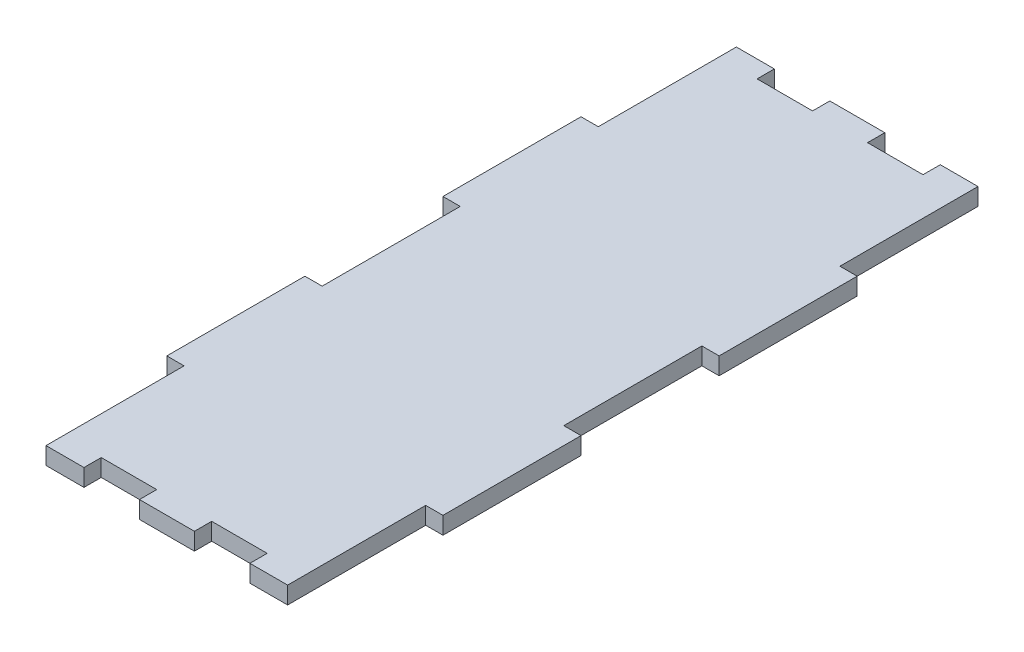
ISO-10303-21;
HEADER;
FILE_DESCRIPTION(('STEP AP214'),'2;1');
FILE_NAME('part.step','',(''),(''),'','','');
FILE_SCHEMA(('AUTOMOTIVE_DESIGN { 1 0 10303 214 1 1 1 1 }'));
ENDSEC;
DATA;
#1=APPLICATION_CONTEXT('core data for automotive mechanical design processes');
#2=APPLICATION_PROTOCOL_DEFINITION('international standard','automotive_design',2000,#1);
#3=PRODUCT_CONTEXT('',#1,'mechanical');
#4=PRODUCT('Part','Part','',(#3));
#5=PRODUCT_RELATED_PRODUCT_CATEGORY('part','',(#4));
#6=PRODUCT_DEFINITION_FORMATION('','',#4);
#7=PRODUCT_DEFINITION_CONTEXT('part definition',#1,'design');
#8=PRODUCT_DEFINITION('design','',#6,#7);
#9=PRODUCT_DEFINITION_SHAPE('','',#8);
#10=(LENGTH_UNIT() NAMED_UNIT(*) SI_UNIT(.MILLI.,.METRE.));
#11=(NAMED_UNIT(*) PLANE_ANGLE_UNIT() SI_UNIT($,.RADIAN.));
#12=(NAMED_UNIT(*) SI_UNIT($,.STERADIAN.) SOLID_ANGLE_UNIT());
#13=UNCERTAINTY_MEASURE_WITH_UNIT(LENGTH_MEASURE(1.E-05),#10,'distance_accuracy_value','');
#14=(GEOMETRIC_REPRESENTATION_CONTEXT(3) GLOBAL_UNCERTAINTY_ASSIGNED_CONTEXT((#13)) GLOBAL_UNIT_ASSIGNED_CONTEXT((#10,
#11,#12)) REPRESENTATION_CONTEXT('',''));
#15=CARTESIAN_POINT('',(0.,0.,0.));
#16=DIRECTION('',(0.,0.,1.));
#17=DIRECTION('',(1.,0.,0.));
#18=AXIS2_PLACEMENT_3D('',#15,#16,#17);
#19=CARTESIAN_POINT('',(-25.4,3.175,-63.5));
#20=DIRECTION('',(0.,0.,1.));
#21=DIRECTION('',(1.,0.,0.));
#22=AXIS2_PLACEMENT_3D('',#19,#20,#21);
#23=PLANE('',#22);
#24=DIRECTION('',(-1.,0.,0.));
#25=VECTOR('',#24,1.);
#26=CARTESIAN_POINT('',(-25.4,3.175,-63.5));
#27=LINE('',#26,#25);
#28=CARTESIAN_POINT('',(-15.24,3.175,-63.5));
#29=VERTEX_POINT('',#28);
#30=CARTESIAN_POINT('',(-22.225,3.175,-63.5));
#31=VERTEX_POINT('',#30);
#32=EDGE_CURVE('E512',#29,#31,#27,.T.);
#33=ORIENTED_EDGE('',*,*,#32,.F.);
#34=DIRECTION('',(0.,1.,0.));
#35=VECTOR('',#34,1.);
#36=CARTESIAN_POINT('',(-15.24,0.,-63.5));
#37=LINE('',#36,#35);
#38=CARTESIAN_POINT('',(-15.24,0.,-63.5));
#39=VERTEX_POINT('',#38);
#40=EDGE_CURVE('E299',#39,#29,#37,.T.);
#41=ORIENTED_EDGE('',*,*,#40,.F.);
#42=DIRECTION('',(-1.,0.,0.));
#43=VECTOR('',#42,1.);
#44=CARTESIAN_POINT('',(-25.4,0.,-63.5));
#45=LINE('',#44,#43);
#46=CARTESIAN_POINT('',(-22.225,0.,-63.5));
#47=VERTEX_POINT('',#46);
#48=EDGE_CURVE('E289',#39,#47,#45,.T.);
#49=ORIENTED_EDGE('',*,*,#48,.T.);
#50=DIRECTION('',(0.,1.,0.));
#51=VECTOR('',#50,1.);
#52=CARTESIAN_POINT('',(-22.225,0.,-63.5));
#53=LINE('',#52,#51);
#54=EDGE_CURVE('E476',#47,#31,#53,.T.);
#55=ORIENTED_EDGE('',*,*,#54,.T.);
#56=EDGE_LOOP('',(#33,#41,#49,#55));
#57=FACE_BOUND('',#56,.T.);
#58=ADVANCED_FACE('F33',(#57),#23,.F.);
#59=CARTESIAN_POINT('',(-25.4,3.175,63.5));
#60=DIRECTION('',(0.,0.,-1.));
#61=DIRECTION('',(-1.,0.,0.));
#62=AXIS2_PLACEMENT_3D('',#59,#60,#61);
#63=PLANE('',#62);
#64=DIRECTION('',(1.,0.,0.));
#65=VECTOR('',#64,1.);
#66=CARTESIAN_POINT('',(-25.4,0.,63.5));
#67=LINE('',#66,#65);
#68=CARTESIAN_POINT('',(-22.225,0.,63.5));
#69=VERTEX_POINT('',#68);
#70=CARTESIAN_POINT('',(-15.24,0.,63.5));
#71=VERTEX_POINT('',#70);
#72=EDGE_CURVE('E37',#69,#71,#67,.T.);
#73=ORIENTED_EDGE('',*,*,#72,.T.);
#74=DIRECTION('',(0.,1.,0.));
#75=VECTOR('',#74,1.);
#76=CARTESIAN_POINT('',(-15.24,0.,63.5));
#77=LINE('',#76,#75);
#78=CARTESIAN_POINT('',(-15.24,3.175,63.5));
#79=VERTEX_POINT('',#78);
#80=EDGE_CURVE('E314',#71,#79,#77,.T.);
#81=ORIENTED_EDGE('',*,*,#80,.T.);
#82=DIRECTION('',(1.,0.,0.));
#83=VECTOR('',#82,1.);
#84=CARTESIAN_POINT('',(-25.4,3.175,63.5));
#85=LINE('',#84,#83);
#86=CARTESIAN_POINT('',(-22.225,3.175,63.5));
#87=VERTEX_POINT('',#86);
#88=EDGE_CURVE('E11',#87,#79,#85,.T.);
#89=ORIENTED_EDGE('',*,*,#88,.F.);
#90=DIRECTION('',(0.,1.,0.));
#91=VECTOR('',#90,1.);
#92=CARTESIAN_POINT('',(-22.225,0.,63.5));
#93=LINE('',#92,#91);
#94=EDGE_CURVE('E454',#69,#87,#93,.T.);
#95=ORIENTED_EDGE('',*,*,#94,.F.);
#96=EDGE_LOOP('',(#73,#81,#89,#95));
#97=FACE_BOUND('',#96,.T.);
#98=ADVANCED_FACE('F658',(#97),#63,.F.);
#99=CARTESIAN_POINT('',(5.08,0.,-63.5));
#100=VERTEX_POINT('',#99);
#101=CARTESIAN_POINT('',(-5.03435241381755,0.,-63.5));
#102=VERTEX_POINT('',#101);
#103=EDGE_CURVE('E526',#100,#102,#45,.T.);
#104=ORIENTED_EDGE('',*,*,#103,.T.);
#105=DIRECTION('',(0.,1.,0.));
#106=VECTOR('',#105,1.);
#107=CARTESIAN_POINT('',(-5.03435241381755,0.,-63.5));
#108=LINE('',#107,#106);
#109=CARTESIAN_POINT('',(-5.03435241381755,3.175,-63.5));
#110=VERTEX_POINT('',#109);
#111=EDGE_CURVE('E302',#102,#110,#108,.T.);
#112=ORIENTED_EDGE('',*,*,#111,.T.);
#113=CARTESIAN_POINT('',(5.08,3.175,-63.5));
#114=VERTEX_POINT('',#113);
#115=EDGE_CURVE('E518',#114,#110,#27,.T.);
#116=ORIENTED_EDGE('',*,*,#115,.F.);
#117=DIRECTION('',(0.,1.,0.));
#118=VECTOR('',#117,1.);
#119=CARTESIAN_POINT('',(5.08,0.,-63.5));
#120=LINE('',#119,#118);
#121=EDGE_CURVE('E348',#100,#114,#120,.T.);
#122=ORIENTED_EDGE('',*,*,#121,.F.);
#123=EDGE_LOOP('',(#104,#112,#116,#122));
#124=FACE_BOUND('',#123,.T.);
#125=ADVANCED_FACE('F580',(#124),#23,.F.);
#126=CARTESIAN_POINT('',(-5.03435241381755,3.175,63.5));
#127=VERTEX_POINT('',#126);
#128=CARTESIAN_POINT('',(5.08,3.175,63.5));
#129=VERTEX_POINT('',#128);
#130=EDGE_CURVE('E42',#127,#129,#85,.T.);
#131=ORIENTED_EDGE('',*,*,#130,.F.);
#132=DIRECTION('',(0.,1.,0.));
#133=VECTOR('',#132,1.);
#134=CARTESIAN_POINT('',(-5.03435241381755,0.,63.5));
#135=LINE('',#134,#133);
#136=CARTESIAN_POINT('',(-5.03435241381755,0.,63.5));
#137=VERTEX_POINT('',#136);
#138=EDGE_CURVE('E325',#137,#127,#135,.T.);
#139=ORIENTED_EDGE('',*,*,#138,.F.);
#140=CARTESIAN_POINT('',(5.08,0.,63.5));
#141=VERTEX_POINT('',#140);
#142=EDGE_CURVE('E533',#137,#141,#67,.T.);
#143=ORIENTED_EDGE('',*,*,#142,.T.);
#144=DIRECTION('',(0.,1.,0.));
#145=VECTOR('',#144,1.);
#146=CARTESIAN_POINT('',(5.08,0.,63.5));
#147=LINE('',#146,#145);
#148=EDGE_CURVE('E367',#141,#129,#147,.T.);
#149=ORIENTED_EDGE('',*,*,#148,.T.);
#150=EDGE_LOOP('',(#131,#139,#143,#149));
#151=FACE_BOUND('',#150,.T.);
#152=ADVANCED_FACE('F669',(#151),#63,.F.);
#153=CARTESIAN_POINT('',(25.4,3.175,63.5));
#154=DIRECTION('',(-1.,0.,0.));
#155=DIRECTION('',(0.,0.,1.));
#156=AXIS2_PLACEMENT_3D('',#153,#154,#155);
#157=PLANE('',#156);
#158=DIRECTION('',(0.,0.,-1.));
#159=VECTOR('',#158,1.);
#160=CARTESIAN_POINT('',(25.4,3.175,63.5));
#161=LINE('',#160,#159);
#162=CARTESIAN_POINT('',(25.4,3.175,38.1));
#163=VERTEX_POINT('',#162);
#164=CARTESIAN_POINT('',(25.4,3.175,12.7));
#165=VERTEX_POINT('',#164);
#166=EDGE_CURVE('E510',#163,#165,#161,.T.);
#167=ORIENTED_EDGE('',*,*,#166,.F.);
#168=DIRECTION('',(0.,1.,0.));
#169=VECTOR('',#168,1.);
#170=CARTESIAN_POINT('',(25.4,0.,38.1));
#171=LINE('',#170,#169);
#172=CARTESIAN_POINT('',(25.4,0.,38.1));
#173=VERTEX_POINT('',#172);
#174=EDGE_CURVE('E389',#173,#163,#171,.T.);
#175=ORIENTED_EDGE('',*,*,#174,.F.);
#176=DIRECTION('',(0.,0.,-1.));
#177=VECTOR('',#176,1.);
#178=CARTESIAN_POINT('',(25.4,0.,63.5));
#179=LINE('',#178,#177);
#180=CARTESIAN_POINT('',(25.4,0.,12.7));
#181=VERTEX_POINT('',#180);
#182=EDGE_CURVE('E521',#173,#181,#179,.T.);
#183=ORIENTED_EDGE('',*,*,#182,.T.);
#184=DIRECTION('',(0.,1.,0.));
#185=VECTOR('',#184,1.);
#186=CARTESIAN_POINT('',(25.4,0.,12.7));
#187=LINE('',#186,#185);
#188=EDGE_CURVE('E419',#181,#165,#187,.T.);
#189=ORIENTED_EDGE('',*,*,#188,.T.);
#190=EDGE_LOOP('',(#167,#175,#183,#189));
#191=FACE_BOUND('',#190,.T.);
#192=ADVANCED_FACE('F627',(#191),#157,.F.);
#193=CARTESIAN_POINT('',(-25.4,3.175,63.5));
#194=DIRECTION('',(1.,0.,0.));
#195=DIRECTION('',(0.,0.,-1.));
#196=AXIS2_PLACEMENT_3D('',#193,#194,#195);
#197=PLANE('',#196);
#198=DIRECTION('',(0.,0.,1.));
#199=VECTOR('',#198,1.);
#200=CARTESIAN_POINT('',(-25.4,3.175,63.5));
#201=LINE('',#200,#199);
#202=CARTESIAN_POINT('',(-25.4,3.175,-38.1));
#203=VERTEX_POINT('',#202);
#204=CARTESIAN_POINT('',(-25.4,3.175,-12.7));
#205=VERTEX_POINT('',#204);
#206=EDGE_CURVE('E519',#203,#205,#201,.T.);
#207=ORIENTED_EDGE('',*,*,#206,.F.);
#208=DIRECTION('',(0.,1.,0.));
#209=VECTOR('',#208,1.);
#210=CARTESIAN_POINT('',(-25.4,0.,-38.1));
#211=LINE('',#210,#209);
#212=CARTESIAN_POINT('',(-25.4,0.,-38.1));
#213=VERTEX_POINT('',#212);
#214=EDGE_CURVE('E471',#213,#203,#211,.T.);
#215=ORIENTED_EDGE('',*,*,#214,.F.);
#216=DIRECTION('',(0.,0.,1.));
#217=VECTOR('',#216,1.);
#218=CARTESIAN_POINT('',(-25.4,0.,63.5));
#219=LINE('',#218,#217);
#220=CARTESIAN_POINT('',(-25.4,0.,-12.7));
#221=VERTEX_POINT('',#220);
#222=EDGE_CURVE('E527',#213,#221,#219,.T.);
#223=ORIENTED_EDGE('',*,*,#222,.T.);
#224=DIRECTION('',(0.,1.,0.));
#225=VECTOR('',#224,1.);
#226=CARTESIAN_POINT('',(-25.4,0.,-12.7));
#227=LINE('',#226,#225);
#228=EDGE_CURVE('E501',#221,#205,#227,.T.);
#229=ORIENTED_EDGE('',*,*,#228,.T.);
#230=EDGE_LOOP('',(#207,#215,#223,#229));
#231=FACE_BOUND('',#230,.T.);
#232=ADVANCED_FACE('F565',(#231),#197,.F.);
#233=CARTESIAN_POINT('',(25.4,3.175,-12.7));
#234=VERTEX_POINT('',#233);
#235=CARTESIAN_POINT('',(25.4,3.175,-38.1));
#236=VERTEX_POINT('',#235);
#237=EDGE_CURVE('E513',#234,#236,#161,.T.);
#238=ORIENTED_EDGE('',*,*,#237,.F.);
#239=DIRECTION('',(0.,1.,0.));
#240=VECTOR('',#239,1.);
#241=CARTESIAN_POINT('',(25.4,0.,-12.7));
#242=LINE('',#241,#240);
#243=CARTESIAN_POINT('',(25.4,0.,-12.7));
#244=VERTEX_POINT('',#243);
#245=EDGE_CURVE('E411',#244,#234,#242,.T.);
#246=ORIENTED_EDGE('',*,*,#245,.F.);
#247=CARTESIAN_POINT('',(25.4,0.,-38.1));
#248=VERTEX_POINT('',#247);
#249=EDGE_CURVE('E504',#244,#248,#179,.T.);
#250=ORIENTED_EDGE('',*,*,#249,.T.);
#251=DIRECTION('',(0.,1.,0.));
#252=VECTOR('',#251,1.);
#253=CARTESIAN_POINT('',(25.4,0.,-38.1));
#254=LINE('',#253,#252);
#255=EDGE_CURVE('E440',#248,#236,#254,.T.);
#256=ORIENTED_EDGE('',*,*,#255,.T.);
#257=EDGE_LOOP('',(#238,#246,#250,#256));
#258=FACE_BOUND('',#257,.T.);
#259=ADVANCED_FACE('F35',(#258),#157,.F.);
#260=CARTESIAN_POINT('',(22.225,0.,-63.5));
#261=VERTEX_POINT('',#260);
#262=CARTESIAN_POINT('',(15.2856475861824,0.,-63.5));
#263=VERTEX_POINT('',#262);
#264=EDGE_CURVE('E523',#261,#263,#45,.T.);
#265=ORIENTED_EDGE('',*,*,#264,.T.);
#266=DIRECTION('',(0.,1.,0.));
#267=VECTOR('',#266,1.);
#268=CARTESIAN_POINT('',(15.2856475861824,0.,-63.5));
#269=LINE('',#268,#267);
#270=CARTESIAN_POINT('',(15.2856475861824,3.175,-63.5));
#271=VERTEX_POINT('',#270);
#272=EDGE_CURVE('E351',#263,#271,#269,.T.);
#273=ORIENTED_EDGE('',*,*,#272,.T.);
#274=CARTESIAN_POINT('',(22.225,3.175,-63.5));
#275=VERTEX_POINT('',#274);
#276=EDGE_CURVE('E514',#275,#271,#27,.T.);
#277=ORIENTED_EDGE('',*,*,#276,.F.);
#278=DIRECTION('',(0.,1.,0.));
#279=VECTOR('',#278,1.);
#280=CARTESIAN_POINT('',(22.225,0.,-63.5));
#281=LINE('',#280,#279);
#282=EDGE_CURVE('E435',#261,#275,#281,.T.);
#283=ORIENTED_EDGE('',*,*,#282,.F.);
#284=EDGE_LOOP('',(#265,#273,#277,#283));
#285=FACE_BOUND('',#284,.T.);
#286=ADVANCED_FACE('F597',(#285),#23,.F.);
#287=CARTESIAN_POINT('',(-25.4,0.,12.7));
#288=VERTEX_POINT('',#287);
#289=CARTESIAN_POINT('',(-25.4,0.,38.1));
#290=VERTEX_POINT('',#289);
#291=EDGE_CURVE('E525',#288,#290,#219,.T.);
#292=ORIENTED_EDGE('',*,*,#291,.T.);
#293=DIRECTION('',(0.,1.,0.));
#294=VECTOR('',#293,1.);
#295=CARTESIAN_POINT('',(-25.4,0.,38.1));
#296=LINE('',#295,#294);
#297=CARTESIAN_POINT('',(-25.4,3.175,38.1));
#298=VERTEX_POINT('',#297);
#299=EDGE_CURVE('E458',#290,#298,#296,.T.);
#300=ORIENTED_EDGE('',*,*,#299,.T.);
#301=CARTESIAN_POINT('',(-25.4,3.175,12.7));
#302=VERTEX_POINT('',#301);
#303=EDGE_CURVE('E517',#302,#298,#201,.T.);
#304=ORIENTED_EDGE('',*,*,#303,.F.);
#305=DIRECTION('',(0.,1.,0.));
#306=VECTOR('',#305,1.);
#307=CARTESIAN_POINT('',(-25.4,0.,12.7));
#308=LINE('',#307,#306);
#309=EDGE_CURVE('E493',#288,#302,#308,.T.);
#310=ORIENTED_EDGE('',*,*,#309,.F.);
#311=EDGE_LOOP('',(#292,#300,#304,#310));
#312=FACE_BOUND('',#311,.T.);
#313=ADVANCED_FACE('F538',(#312),#197,.F.);
#314=CARTESIAN_POINT('',(15.2856475861824,3.175,63.5));
#315=VERTEX_POINT('',#314);
#316=CARTESIAN_POINT('',(22.225,3.175,63.5));
#317=VERTEX_POINT('',#316);
#318=EDGE_CURVE('E44',#315,#317,#85,.T.);
#319=ORIENTED_EDGE('',*,*,#318,.F.);
#320=DIRECTION('',(0.,1.,0.));
#321=VECTOR('',#320,1.);
#322=CARTESIAN_POINT('',(15.2856475861824,0.,63.5));
#323=LINE('',#322,#321);
#324=CARTESIAN_POINT('',(15.2856475861824,0.,63.5));
#325=VERTEX_POINT('',#324);
#326=EDGE_CURVE('E378',#325,#315,#323,.T.);
#327=ORIENTED_EDGE('',*,*,#326,.F.);
#328=CARTESIAN_POINT('',(22.225,0.,63.5));
#329=VERTEX_POINT('',#328);
#330=EDGE_CURVE('E528',#325,#329,#67,.T.);
#331=ORIENTED_EDGE('',*,*,#330,.T.);
#332=DIRECTION('',(0.,1.,0.));
#333=VECTOR('',#332,1.);
#334=CARTESIAN_POINT('',(22.225,0.,63.5));
#335=LINE('',#334,#333);
#336=EDGE_CURVE('E394',#329,#317,#335,.T.);
#337=ORIENTED_EDGE('',*,*,#336,.T.);
#338=EDGE_LOOP('',(#319,#327,#331,#337));
#339=FACE_BOUND('',#338,.T.);
#340=ADVANCED_FACE('F639',(#339),#63,.F.);
#341=CARTESIAN_POINT('',(0.,3.175,0.));
#342=DIRECTION('',(0.,-1.,0.));
#343=DIRECTION('',(0.,0.,-1.));
#344=AXIS2_PLACEMENT_3D('',#341,#342,#343);
#345=PLANE('',#344);
#346=DIRECTION('',(1.,0.,0.));
#347=VECTOR('',#346,1.);
#348=CARTESIAN_POINT('',(-15.24,3.175,-60.325));
#349=LINE('',#348,#347);
#350=CARTESIAN_POINT('',(-15.24,3.175,-60.325));
#351=VERTEX_POINT('',#350);
#352=CARTESIAN_POINT('',(-5.03435241381755,3.175,-60.325));
#353=VERTEX_POINT('',#352);
#354=EDGE_CURVE('E292',#351,#353,#349,.T.);
#355=ORIENTED_EDGE('',*,*,#354,.F.);
#356=DIRECTION('',(0.,0.,1.));
#357=VECTOR('',#356,1.);
#358=CARTESIAN_POINT('',(-15.24,3.175,-60.325));
#359=LINE('',#358,#357);
#360=EDGE_CURVE('E275',#29,#351,#359,.T.);
#361=ORIENTED_EDGE('',*,*,#360,.F.);
#362=ORIENTED_EDGE('',*,*,#32,.T.);
#363=DIRECTION('',(0.,0.,-1.));
#364=VECTOR('',#363,1.);
#365=CARTESIAN_POINT('',(-22.225,3.175,-38.1));
#366=LINE('',#365,#364);
#367=CARTESIAN_POINT('',(-22.225,3.175,-38.1));
#368=VERTEX_POINT('',#367);
#369=EDGE_CURVE('E469',#368,#31,#366,.T.);
#370=ORIENTED_EDGE('',*,*,#369,.F.);
#371=DIRECTION('',(1.,0.,0.));
#372=VECTOR('',#371,1.);
#373=CARTESIAN_POINT('',(-25.4,3.175,-38.1));
#374=LINE('',#373,#372);
#375=EDGE_CURVE('E461',#203,#368,#374,.T.);
#376=ORIENTED_EDGE('',*,*,#375,.F.);
#377=ORIENTED_EDGE('',*,*,#206,.T.);
#378=DIRECTION('',(-1.,0.,0.));
#379=VECTOR('',#378,1.);
#380=CARTESIAN_POINT('',(-25.4,3.175,-12.7));
#381=LINE('',#380,#379);
#382=CARTESIAN_POINT('',(-22.225,3.175,-12.7));
#383=VERTEX_POINT('',#382);
#384=EDGE_CURVE('E487',#383,#205,#381,.T.);
#385=ORIENTED_EDGE('',*,*,#384,.F.);
#386=DIRECTION('',(0.,0.,-1.));
#387=VECTOR('',#386,1.);
#388=CARTESIAN_POINT('',(-22.225,3.175,12.7));
#389=LINE('',#388,#387);
#390=CARTESIAN_POINT('',(-22.225,3.175,12.7));
#391=VERTEX_POINT('',#390);
#392=EDGE_CURVE('E496',#391,#383,#389,.T.);
#393=ORIENTED_EDGE('',*,*,#392,.F.);
#394=DIRECTION('',(1.,0.,0.));
#395=VECTOR('',#394,1.);
#396=CARTESIAN_POINT('',(-25.4,3.175,12.7));
#397=LINE('',#396,#395);
#398=EDGE_CURVE('E479',#302,#391,#397,.T.);
#399=ORIENTED_EDGE('',*,*,#398,.F.);
#400=ORIENTED_EDGE('',*,*,#303,.T.);
#401=DIRECTION('',(-1.,0.,0.));
#402=VECTOR('',#401,1.);
#403=CARTESIAN_POINT('',(-25.4,3.175,38.1));
#404=LINE('',#403,#402);
#405=CARTESIAN_POINT('',(-22.225,3.175,38.1));
#406=VERTEX_POINT('',#405);
#407=EDGE_CURVE('E451',#406,#298,#404,.T.);
#408=ORIENTED_EDGE('',*,*,#407,.F.);
#409=DIRECTION('',(0.,0.,-1.));
#410=VECTOR('',#409,1.);
#411=CARTESIAN_POINT('',(-22.225,3.175,63.5));
#412=LINE('',#411,#410);
#413=EDGE_CURVE('E443',#87,#406,#412,.T.);
#414=ORIENTED_EDGE('',*,*,#413,.F.);
#415=ORIENTED_EDGE('',*,*,#88,.T.);
#416=DIRECTION('',(0.,0.,1.));
#417=VECTOR('',#416,1.);
#418=CARTESIAN_POINT('',(-15.24,3.175,63.5));
#419=LINE('',#418,#417);
#420=CARTESIAN_POINT('',(-15.24,3.175,60.325));
#421=VERTEX_POINT('',#420);
#422=EDGE_CURVE('E315',#421,#79,#419,.T.);
#423=ORIENTED_EDGE('',*,*,#422,.F.);
#424=DIRECTION('',(-1.,0.,0.));
#425=VECTOR('',#424,1.);
#426=CARTESIAN_POINT('',(-15.24,3.175,60.325));
#427=LINE('',#426,#425);
#428=CARTESIAN_POINT('',(-5.03435241381755,3.175,60.325));
#429=VERTEX_POINT('',#428);
#430=EDGE_CURVE('E310',#429,#421,#427,.T.);
#431=ORIENTED_EDGE('',*,*,#430,.F.);
#432=DIRECTION('',(0.,0.,-1.));
#433=VECTOR('',#432,1.);
#434=CARTESIAN_POINT('',(-5.03435241381755,3.175,63.5));
#435=LINE('',#434,#433);
#436=EDGE_CURVE('E317',#127,#429,#435,.T.);
#437=ORIENTED_EDGE('',*,*,#436,.F.);
#438=ORIENTED_EDGE('',*,*,#130,.T.);
#439=DIRECTION('',(0.,0.,1.));
#440=VECTOR('',#439,1.);
#441=CARTESIAN_POINT('',(5.08,3.175,63.5));
#442=LINE('',#441,#440);
#443=CARTESIAN_POINT('',(5.08,3.175,60.325));
#444=VERTEX_POINT('',#443);
#445=EDGE_CURVE('E301',#444,#129,#442,.T.);
#446=ORIENTED_EDGE('',*,*,#445,.F.);
#447=DIRECTION('',(-1.,0.,0.));
#448=VECTOR('',#447,1.);
#449=CARTESIAN_POINT('',(5.08,3.175,60.325));
#450=LINE('',#449,#448);
#451=CARTESIAN_POINT('',(15.2856475861824,3.175,60.325));
#452=VERTEX_POINT('',#451);
#453=EDGE_CURVE('E361',#452,#444,#450,.T.);
#454=ORIENTED_EDGE('',*,*,#453,.F.);
#455=DIRECTION('',(0.,0.,-1.));
#456=VECTOR('',#455,1.);
#457=CARTESIAN_POINT('',(15.2856475861824,3.175,63.5));
#458=LINE('',#457,#456);
#459=EDGE_CURVE('E370',#315,#452,#458,.T.);
#460=ORIENTED_EDGE('',*,*,#459,.F.);
#461=ORIENTED_EDGE('',*,*,#318,.T.);
#462=DIRECTION('',(0.,0.,1.));
#463=VECTOR('',#462,1.);
#464=CARTESIAN_POINT('',(22.225,3.175,38.1));
#465=LINE('',#464,#463);
#466=CARTESIAN_POINT('',(22.225,3.175,38.1));
#467=VERTEX_POINT('',#466);
#468=EDGE_CURVE('E386',#467,#317,#465,.T.);
#469=ORIENTED_EDGE('',*,*,#468,.F.);
#470=DIRECTION('',(-1.,0.,0.));
#471=VECTOR('',#470,1.);
#472=CARTESIAN_POINT('',(25.4,3.175,38.1));
#473=LINE('',#472,#471);
#474=EDGE_CURVE('E350',#163,#467,#473,.T.);
#475=ORIENTED_EDGE('',*,*,#474,.F.);
#476=ORIENTED_EDGE('',*,*,#166,.T.);
#477=DIRECTION('',(1.,0.,0.));
#478=VECTOR('',#477,1.);
#479=CARTESIAN_POINT('',(25.4,3.175,12.7));
#480=LINE('',#479,#478);
#481=CARTESIAN_POINT('',(22.225,3.175,12.7));
#482=VERTEX_POINT('',#481);
#483=EDGE_CURVE('E405',#482,#165,#480,.T.);
#484=ORIENTED_EDGE('',*,*,#483,.F.);
#485=DIRECTION('',(0.,0.,1.));
#486=VECTOR('',#485,1.);
#487=CARTESIAN_POINT('',(22.225,3.175,-12.7));
#488=LINE('',#487,#486);
#489=CARTESIAN_POINT('',(22.225,3.175,-12.7));
#490=VERTEX_POINT('',#489);
#491=EDGE_CURVE('E414',#490,#482,#488,.T.);
#492=ORIENTED_EDGE('',*,*,#491,.F.);
#493=DIRECTION('',(-1.,0.,0.));
#494=VECTOR('',#493,1.);
#495=CARTESIAN_POINT('',(25.4,3.175,-12.7));
#496=LINE('',#495,#494);
#497=EDGE_CURVE('E397',#234,#490,#496,.T.);
#498=ORIENTED_EDGE('',*,*,#497,.F.);
#499=ORIENTED_EDGE('',*,*,#237,.T.);
#500=DIRECTION('',(1.,0.,0.));
#501=VECTOR('',#500,1.);
#502=CARTESIAN_POINT('',(25.4,3.175,-38.1));
#503=LINE('',#502,#501);
#504=CARTESIAN_POINT('',(22.225,3.175,-38.1));
#505=VERTEX_POINT('',#504);
#506=EDGE_CURVE('E432',#505,#236,#503,.T.);
#507=ORIENTED_EDGE('',*,*,#506,.F.);
#508=DIRECTION('',(0.,0.,1.));
#509=VECTOR('',#508,1.);
#510=CARTESIAN_POINT('',(22.225,3.175,-63.5));
#511=LINE('',#510,#509);
#512=EDGE_CURVE('E422',#275,#505,#511,.T.);
#513=ORIENTED_EDGE('',*,*,#512,.F.);
#514=ORIENTED_EDGE('',*,*,#276,.T.);
#515=DIRECTION('',(0.,0.,-1.));
#516=VECTOR('',#515,1.);
#517=CARTESIAN_POINT('',(15.2856475861824,3.175,-60.325));
#518=LINE('',#517,#516);
#519=CARTESIAN_POINT('',(15.2856475861824,3.175,-60.325));
#520=VERTEX_POINT('',#519);
#521=EDGE_CURVE('E333',#520,#271,#518,.T.);
#522=ORIENTED_EDGE('',*,*,#521,.F.);
#523=DIRECTION('',(1.,0.,0.));
#524=VECTOR('',#523,1.);
#525=CARTESIAN_POINT('',(5.08,3.175,-60.325));
#526=LINE('',#525,#524);
#527=CARTESIAN_POINT('',(5.08,3.175,-60.325));
#528=VERTEX_POINT('',#527);
#529=EDGE_CURVE('E343',#528,#520,#526,.T.);
#530=ORIENTED_EDGE('',*,*,#529,.F.);
#531=DIRECTION('',(0.,0.,1.));
#532=VECTOR('',#531,1.);
#533=CARTESIAN_POINT('',(5.08,3.175,-60.325));
#534=LINE('',#533,#532);
#535=EDGE_CURVE('E340',#114,#528,#534,.T.);
#536=ORIENTED_EDGE('',*,*,#535,.F.);
#537=ORIENTED_EDGE('',*,*,#115,.T.);
#538=DIRECTION('',(0.,0.,-1.));
#539=VECTOR('',#538,1.);
#540=CARTESIAN_POINT('',(-5.03435241381755,3.175,-60.325));
#541=LINE('',#540,#539);
#542=EDGE_CURVE('E290',#353,#110,#541,.T.);
#543=ORIENTED_EDGE('',*,*,#542,.F.);
#544=EDGE_LOOP('',(#355,#361,#362,#370,#376,#377,#385,#393,#399,#400,#408,#414,#415,#423,#431,
#437,#438,#446,#454,#460,#461,#469,#475,#476,#484,#492,#498,#499,#507,#513,#514,#522,#530,#536,
#537,#543));
#545=FACE_BOUND('',#544,.T.);
#546=ADVANCED_FACE('F552',(#545),#345,.F.);
#547=CARTESIAN_POINT('',(0.,0.,0.));
#548=DIRECTION('',(0.,-1.,0.));
#549=DIRECTION('',(0.,0.,-1.));
#550=AXIS2_PLACEMENT_3D('',#547,#548,#549);
#551=PLANE('',#550);
#552=DIRECTION('',(0.,0.,1.));
#553=VECTOR('',#552,1.);
#554=CARTESIAN_POINT('',(-15.24,0.,-60.325));
#555=LINE('',#554,#553);
#556=CARTESIAN_POINT('',(-15.24,0.,-60.325));
#557=VERTEX_POINT('',#556);
#558=EDGE_CURVE('E272',#39,#557,#555,.T.);
#559=ORIENTED_EDGE('',*,*,#558,.T.);
#560=DIRECTION('',(1.,0.,0.));
#561=VECTOR('',#560,1.);
#562=CARTESIAN_POINT('',(-15.24,0.,-60.325));
#563=LINE('',#562,#561);
#564=CARTESIAN_POINT('',(-5.03435241381755,0.,-60.325));
#565=VERTEX_POINT('',#564);
#566=EDGE_CURVE('E282',#557,#565,#563,.T.);
#567=ORIENTED_EDGE('',*,*,#566,.T.);
#568=DIRECTION('',(0.,0.,-1.));
#569=VECTOR('',#568,1.);
#570=CARTESIAN_POINT('',(-5.03435241381755,0.,-60.325));
#571=LINE('',#570,#569);
#572=EDGE_CURVE('E51',#565,#102,#571,.T.);
#573=ORIENTED_EDGE('',*,*,#572,.T.);
#574=ORIENTED_EDGE('',*,*,#103,.F.);
#575=DIRECTION('',(0.,0.,1.));
#576=VECTOR('',#575,1.);
#577=CARTESIAN_POINT('',(5.08,0.,-60.325));
#578=LINE('',#577,#576);
#579=CARTESIAN_POINT('',(5.08,0.,-60.325));
#580=VERTEX_POINT('',#579);
#581=EDGE_CURVE('E329',#100,#580,#578,.T.);
#582=ORIENTED_EDGE('',*,*,#581,.T.);
#583=DIRECTION('',(1.,0.,0.));
#584=VECTOR('',#583,1.);
#585=CARTESIAN_POINT('',(5.08,0.,-60.325));
#586=LINE('',#585,#584);
#587=CARTESIAN_POINT('',(15.2856475861824,0.,-60.325));
#588=VERTEX_POINT('',#587);
#589=EDGE_CURVE('E332',#580,#588,#586,.T.);
#590=ORIENTED_EDGE('',*,*,#589,.T.);
#591=DIRECTION('',(0.,0.,-1.));
#592=VECTOR('',#591,1.);
#593=CARTESIAN_POINT('',(15.2856475861824,0.,-60.325));
#594=LINE('',#593,#592);
#595=EDGE_CURVE('E336',#588,#263,#594,.T.);
#596=ORIENTED_EDGE('',*,*,#595,.T.);
#597=ORIENTED_EDGE('',*,*,#264,.F.);
#598=DIRECTION('',(0.,0.,1.));
#599=VECTOR('',#598,1.);
#600=CARTESIAN_POINT('',(22.225,0.,-63.5));
#601=LINE('',#600,#599);
#602=CARTESIAN_POINT('',(22.225,0.,-38.1));
#603=VERTEX_POINT('',#602);
#604=EDGE_CURVE('E428',#261,#603,#601,.T.);
#605=ORIENTED_EDGE('',*,*,#604,.T.);
#606=DIRECTION('',(1.,0.,0.));
#607=VECTOR('',#606,1.);
#608=CARTESIAN_POINT('',(25.4,0.,-38.1));
#609=LINE('',#608,#607);
#610=EDGE_CURVE('E431',#603,#248,#609,.T.);
#611=ORIENTED_EDGE('',*,*,#610,.T.);
#612=ORIENTED_EDGE('',*,*,#249,.F.);
#613=DIRECTION('',(-1.,0.,0.));
#614=VECTOR('',#613,1.);
#615=CARTESIAN_POINT('',(25.4,0.,-12.7));
#616=LINE('',#615,#614);
#617=CARTESIAN_POINT('',(22.225,0.,-12.7));
#618=VERTEX_POINT('',#617);
#619=EDGE_CURVE('E401',#244,#618,#616,.T.);
#620=ORIENTED_EDGE('',*,*,#619,.T.);
#621=DIRECTION('',(0.,0.,1.));
#622=VECTOR('',#621,1.);
#623=CARTESIAN_POINT('',(22.225,0.,-12.7));
#624=LINE('',#623,#622);
#625=CARTESIAN_POINT('',(22.225,0.,12.7));
#626=VERTEX_POINT('',#625);
#627=EDGE_CURVE('E404',#618,#626,#624,.T.);
#628=ORIENTED_EDGE('',*,*,#627,.T.);
#629=DIRECTION('',(1.,0.,0.));
#630=VECTOR('',#629,1.);
#631=CARTESIAN_POINT('',(25.4,0.,12.7));
#632=LINE('',#631,#630);
#633=EDGE_CURVE('E408',#626,#181,#632,.T.);
#634=ORIENTED_EDGE('',*,*,#633,.T.);
#635=ORIENTED_EDGE('',*,*,#182,.F.);
#636=DIRECTION('',(-1.,0.,0.));
#637=VECTOR('',#636,1.);
#638=CARTESIAN_POINT('',(25.4,0.,38.1));
#639=LINE('',#638,#637);
#640=CARTESIAN_POINT('',(22.225,0.,38.1));
#641=VERTEX_POINT('',#640);
#642=EDGE_CURVE('E382',#173,#641,#639,.T.);
#643=ORIENTED_EDGE('',*,*,#642,.T.);
#644=DIRECTION('',(0.,0.,1.));
#645=VECTOR('',#644,1.);
#646=CARTESIAN_POINT('',(22.225,0.,38.1));
#647=LINE('',#646,#645);
#648=EDGE_CURVE('E385',#641,#329,#647,.T.);
#649=ORIENTED_EDGE('',*,*,#648,.T.);
#650=ORIENTED_EDGE('',*,*,#330,.F.);
#651=DIRECTION('',(0.,0.,-1.));
#652=VECTOR('',#651,1.);
#653=CARTESIAN_POINT('',(15.2856475861824,0.,63.5));
#654=LINE('',#653,#652);
#655=CARTESIAN_POINT('',(15.2856475861824,0.,60.325));
#656=VERTEX_POINT('',#655);
#657=EDGE_CURVE('E360',#325,#656,#654,.T.);
#658=ORIENTED_EDGE('',*,*,#657,.T.);
#659=DIRECTION('',(-1.,0.,0.));
#660=VECTOR('',#659,1.);
#661=CARTESIAN_POINT('',(5.08,0.,60.325));
#662=LINE('',#661,#660);
#663=CARTESIAN_POINT('',(5.08,0.,60.325));
#664=VERTEX_POINT('',#663);
#665=EDGE_CURVE('E364',#656,#664,#662,.T.);
#666=ORIENTED_EDGE('',*,*,#665,.T.);
#667=DIRECTION('',(0.,0.,1.));
#668=VECTOR('',#667,1.);
#669=CARTESIAN_POINT('',(5.08,0.,63.5));
#670=LINE('',#669,#668);
#671=EDGE_CURVE('E357',#664,#141,#670,.T.);
#672=ORIENTED_EDGE('',*,*,#671,.T.);
#673=ORIENTED_EDGE('',*,*,#142,.F.);
#674=DIRECTION('',(0.,0.,-1.));
#675=VECTOR('',#674,1.);
#676=CARTESIAN_POINT('',(-5.03435241381755,0.,63.5));
#677=LINE('',#676,#675);
#678=CARTESIAN_POINT('',(-5.03435241381755,0.,60.325));
#679=VERTEX_POINT('',#678);
#680=EDGE_CURVE('E309',#137,#679,#677,.T.);
#681=ORIENTED_EDGE('',*,*,#680,.T.);
#682=DIRECTION('',(-1.,0.,0.));
#683=VECTOR('',#682,1.);
#684=CARTESIAN_POINT('',(-15.24,0.,60.325));
#685=LINE('',#684,#683);
#686=CARTESIAN_POINT('',(-15.24,0.,60.325));
#687=VERTEX_POINT('',#686);
#688=EDGE_CURVE('E59',#679,#687,#685,.T.);
#689=ORIENTED_EDGE('',*,*,#688,.T.);
#690=DIRECTION('',(0.,0.,1.));
#691=VECTOR('',#690,1.);
#692=CARTESIAN_POINT('',(-15.24,0.,63.5));
#693=LINE('',#692,#691);
#694=EDGE_CURVE('E306',#687,#71,#693,.T.);
#695=ORIENTED_EDGE('',*,*,#694,.T.);
#696=ORIENTED_EDGE('',*,*,#72,.F.);
#697=DIRECTION('',(0.,0.,-1.));
#698=VECTOR('',#697,1.);
#699=CARTESIAN_POINT('',(-22.225,0.,63.5));
#700=LINE('',#699,#698);
#701=CARTESIAN_POINT('',(-22.225,0.,38.1));
#702=VERTEX_POINT('',#701);
#703=EDGE_CURVE('E447',#69,#702,#700,.T.);
#704=ORIENTED_EDGE('',*,*,#703,.T.);
#705=DIRECTION('',(-1.,0.,0.));
#706=VECTOR('',#705,1.);
#707=CARTESIAN_POINT('',(-25.4,0.,38.1));
#708=LINE('',#707,#706);
#709=EDGE_CURVE('E450',#702,#290,#708,.T.);
#710=ORIENTED_EDGE('',*,*,#709,.T.);
#711=ORIENTED_EDGE('',*,*,#291,.F.);
#712=DIRECTION('',(1.,0.,0.));
#713=VECTOR('',#712,1.);
#714=CARTESIAN_POINT('',(-25.4,0.,12.7));
#715=LINE('',#714,#713);
#716=CARTESIAN_POINT('',(-22.225,0.,12.7));
#717=VERTEX_POINT('',#716);
#718=EDGE_CURVE('E483',#288,#717,#715,.T.);
#719=ORIENTED_EDGE('',*,*,#718,.T.);
#720=DIRECTION('',(0.,0.,-1.));
#721=VECTOR('',#720,1.);
#722=CARTESIAN_POINT('',(-22.225,0.,12.7));
#723=LINE('',#722,#721);
#724=CARTESIAN_POINT('',(-22.225,0.,-12.7));
#725=VERTEX_POINT('',#724);
#726=EDGE_CURVE('E486',#717,#725,#723,.T.);
#727=ORIENTED_EDGE('',*,*,#726,.T.);
#728=DIRECTION('',(-1.,0.,0.));
#729=VECTOR('',#728,1.);
#730=CARTESIAN_POINT('',(-25.4,0.,-12.7));
#731=LINE('',#730,#729);
#732=EDGE_CURVE('E490',#725,#221,#731,.T.);
#733=ORIENTED_EDGE('',*,*,#732,.T.);
#734=ORIENTED_EDGE('',*,*,#222,.F.);
#735=DIRECTION('',(1.,0.,0.));
#736=VECTOR('',#735,1.);
#737=CARTESIAN_POINT('',(-25.4,0.,-38.1));
#738=LINE('',#737,#736);
#739=CARTESIAN_POINT('',(-22.225,0.,-38.1));
#740=VERTEX_POINT('',#739);
#741=EDGE_CURVE('E465',#213,#740,#738,.T.);
#742=ORIENTED_EDGE('',*,*,#741,.T.);
#743=DIRECTION('',(0.,0.,-1.));
#744=VECTOR('',#743,1.);
#745=CARTESIAN_POINT('',(-22.225,0.,-38.1));
#746=LINE('',#745,#744);
#747=EDGE_CURVE('E468',#740,#47,#746,.T.);
#748=ORIENTED_EDGE('',*,*,#747,.T.);
#749=ORIENTED_EDGE('',*,*,#48,.F.);
#750=EDGE_LOOP('',(#559,#567,#573,#574,#582,#590,#596,#597,#605,#611,#612,#620,#628,#634,#635,
#643,#649,#650,#658,#666,#672,#673,#681,#689,#695,#696,#704,#710,#711,#719,#727,#733,#734,#742,
#748,#749));
#751=FACE_BOUND('',#750,.T.);
#752=ADVANCED_FACE('F287',(#751),#551,.T.);
#753=CARTESIAN_POINT('',(-25.4,0.,-12.7));
#754=DIRECTION('',(0.,0.,-1.));
#755=DIRECTION('',(-1.,0.,0.));
#756=AXIS2_PLACEMENT_3D('',#753,#754,#755);
#757=PLANE('',#756);
#758=ORIENTED_EDGE('',*,*,#384,.T.);
#759=ORIENTED_EDGE('',*,*,#228,.F.);
#760=ORIENTED_EDGE('',*,*,#732,.F.);
#761=DIRECTION('',(0.,1.,0.));
#762=VECTOR('',#761,1.);
#763=CARTESIAN_POINT('',(-22.225,0.,-12.7));
#764=LINE('',#763,#762);
#765=EDGE_CURVE('E505',#725,#383,#764,.T.);
#766=ORIENTED_EDGE('',*,*,#765,.T.);
#767=EDGE_LOOP('',(#758,#759,#760,#766));
#768=FACE_BOUND('',#767,.T.);
#769=ADVANCED_FACE('F563',(#768),#757,.F.);
#770=CARTESIAN_POINT('',(-22.225,0.,12.7));
#771=DIRECTION('',(1.,0.,0.));
#772=DIRECTION('',(0.,0.,-1.));
#773=AXIS2_PLACEMENT_3D('',#770,#771,#772);
#774=PLANE('',#773);
#775=ORIENTED_EDGE('',*,*,#392,.T.);
#776=ORIENTED_EDGE('',*,*,#765,.F.);
#777=ORIENTED_EDGE('',*,*,#726,.F.);
#778=DIRECTION('',(0.,1.,0.));
#779=VECTOR('',#778,1.);
#780=CARTESIAN_POINT('',(-22.225,0.,12.7));
#781=LINE('',#780,#779);
#782=EDGE_CURVE('E507',#717,#391,#781,.T.);
#783=ORIENTED_EDGE('',*,*,#782,.T.);
#784=EDGE_LOOP('',(#775,#776,#777,#783));
#785=FACE_BOUND('',#784,.T.);
#786=ADVANCED_FACE('F560',(#785),#774,.F.);
#787=CARTESIAN_POINT('',(-25.4,0.,12.7));
#788=DIRECTION('',(0.,0.,1.));
#789=DIRECTION('',(1.,0.,0.));
#790=AXIS2_PLACEMENT_3D('',#787,#788,#789);
#791=PLANE('',#790);
#792=ORIENTED_EDGE('',*,*,#398,.T.);
#793=ORIENTED_EDGE('',*,*,#782,.F.);
#794=ORIENTED_EDGE('',*,*,#718,.F.);
#795=ORIENTED_EDGE('',*,*,#309,.T.);
#796=EDGE_LOOP('',(#792,#793,#794,#795));
#797=FACE_BOUND('',#796,.T.);
#798=ADVANCED_FACE('F558',(#797),#791,.F.);
#799=CARTESIAN_POINT('',(-22.225,0.,-38.1));
#800=DIRECTION('',(1.,0.,0.));
#801=DIRECTION('',(0.,0.,-1.));
#802=AXIS2_PLACEMENT_3D('',#799,#800,#801);
#803=PLANE('',#802);
#804=ORIENTED_EDGE('',*,*,#369,.T.);
#805=ORIENTED_EDGE('',*,*,#54,.F.);
#806=ORIENTED_EDGE('',*,*,#747,.F.);
#807=DIRECTION('',(0.,1.,0.));
#808=VECTOR('',#807,1.);
#809=CARTESIAN_POINT('',(-22.225,0.,-38.1));
#810=LINE('',#809,#808);
#811=EDGE_CURVE('E480',#740,#368,#810,.T.);
#812=ORIENTED_EDGE('',*,*,#811,.T.);
#813=EDGE_LOOP('',(#804,#805,#806,#812));
#814=FACE_BOUND('',#813,.T.);
#815=ADVANCED_FACE('F573',(#814),#803,.F.);
#816=CARTESIAN_POINT('',(-25.4,0.,-38.1));
#817=DIRECTION('',(0.,0.,1.));
#818=DIRECTION('',(1.,0.,0.));
#819=AXIS2_PLACEMENT_3D('',#816,#817,#818);
#820=PLANE('',#819);
#821=ORIENTED_EDGE('',*,*,#375,.T.);
#822=ORIENTED_EDGE('',*,*,#811,.F.);
#823=ORIENTED_EDGE('',*,*,#741,.F.);
#824=ORIENTED_EDGE('',*,*,#214,.T.);
#825=EDGE_LOOP('',(#821,#822,#823,#824));
#826=FACE_BOUND('',#825,.T.);
#827=ADVANCED_FACE('F570',(#826),#820,.F.);
#828=CARTESIAN_POINT('',(-25.4,0.,38.1));
#829=DIRECTION('',(0.,0.,-1.));
#830=DIRECTION('',(-1.,0.,0.));
#831=AXIS2_PLACEMENT_3D('',#828,#829,#830);
#832=PLANE('',#831);
#833=ORIENTED_EDGE('',*,*,#407,.T.);
#834=ORIENTED_EDGE('',*,*,#299,.F.);
#835=ORIENTED_EDGE('',*,*,#709,.F.);
#836=DIRECTION('',(0.,1.,0.));
#837=VECTOR('',#836,1.);
#838=CARTESIAN_POINT('',(-22.225,0.,38.1));
#839=LINE('',#838,#837);
#840=EDGE_CURVE('E462',#702,#406,#839,.T.);
#841=ORIENTED_EDGE('',*,*,#840,.T.);
#842=EDGE_LOOP('',(#833,#834,#835,#841));
#843=FACE_BOUND('',#842,.T.);
#844=ADVANCED_FACE('F544',(#843),#832,.F.);
#845=CARTESIAN_POINT('',(-22.225,0.,63.5));
#846=DIRECTION('',(1.,0.,0.));
#847=DIRECTION('',(0.,0.,-1.));
#848=AXIS2_PLACEMENT_3D('',#845,#846,#847);
#849=PLANE('',#848);
#850=ORIENTED_EDGE('',*,*,#413,.T.);
#851=ORIENTED_EDGE('',*,*,#840,.F.);
#852=ORIENTED_EDGE('',*,*,#703,.F.);
#853=ORIENTED_EDGE('',*,*,#94,.T.);
#854=EDGE_LOOP('',(#850,#851,#852,#853));
#855=FACE_BOUND('',#854,.T.);
#856=ADVANCED_FACE('F546',(#855),#849,.F.);
#857=CARTESIAN_POINT('',(25.4,0.,-38.1));
#858=DIRECTION('',(0.,0.,1.));
#859=DIRECTION('',(1.,0.,0.));
#860=AXIS2_PLACEMENT_3D('',#857,#858,#859);
#861=PLANE('',#860);
#862=ORIENTED_EDGE('',*,*,#506,.T.);
#863=ORIENTED_EDGE('',*,*,#255,.F.);
#864=ORIENTED_EDGE('',*,*,#610,.F.);
#865=DIRECTION('',(0.,1.,0.));
#866=VECTOR('',#865,1.);
#867=CARTESIAN_POINT('',(22.225,0.,-38.1));
#868=LINE('',#867,#866);
#869=EDGE_CURVE('E444',#603,#505,#868,.T.);
#870=ORIENTED_EDGE('',*,*,#869,.T.);
#871=EDGE_LOOP('',(#862,#863,#864,#870));
#872=FACE_BOUND('',#871,.T.);
#873=ADVANCED_FACE('F608',(#872),#861,.F.);
#874=CARTESIAN_POINT('',(22.225,0.,-63.5));
#875=DIRECTION('',(-1.,0.,0.));
#876=DIRECTION('',(0.,0.,1.));
#877=AXIS2_PLACEMENT_3D('',#874,#875,#876);
#878=PLANE('',#877);
#879=ORIENTED_EDGE('',*,*,#512,.T.);
#880=ORIENTED_EDGE('',*,*,#869,.F.);
#881=ORIENTED_EDGE('',*,*,#604,.F.);
#882=ORIENTED_EDGE('',*,*,#282,.T.);
#883=EDGE_LOOP('',(#879,#880,#881,#882));
#884=FACE_BOUND('',#883,.T.);
#885=ADVANCED_FACE('F601',(#884),#878,.F.);
#886=CARTESIAN_POINT('',(25.4,0.,12.7));
#887=DIRECTION('',(0.,0.,1.));
#888=DIRECTION('',(1.,0.,0.));
#889=AXIS2_PLACEMENT_3D('',#886,#887,#888);
#890=PLANE('',#889);
#891=ORIENTED_EDGE('',*,*,#483,.T.);
#892=ORIENTED_EDGE('',*,*,#188,.F.);
#893=ORIENTED_EDGE('',*,*,#633,.F.);
#894=DIRECTION('',(0.,1.,0.));
#895=VECTOR('',#894,1.);
#896=CARTESIAN_POINT('',(22.225,0.,12.7));
#897=LINE('',#896,#895);
#898=EDGE_CURVE('E423',#626,#482,#897,.T.);
#899=ORIENTED_EDGE('',*,*,#898,.T.);
#900=EDGE_LOOP('',(#891,#892,#893,#899));
#901=FACE_BOUND('',#900,.T.);
#902=ADVANCED_FACE('F622',(#901),#890,.F.);
#903=CARTESIAN_POINT('',(22.225,0.,-12.7));
#904=DIRECTION('',(-1.,0.,0.));
#905=DIRECTION('',(0.,0.,1.));
#906=AXIS2_PLACEMENT_3D('',#903,#904,#905);
#907=PLANE('',#906);
#908=ORIENTED_EDGE('',*,*,#491,.T.);
#909=ORIENTED_EDGE('',*,*,#898,.F.);
#910=ORIENTED_EDGE('',*,*,#627,.F.);
#911=DIRECTION('',(0.,1.,0.));
#912=VECTOR('',#911,1.);
#913=CARTESIAN_POINT('',(22.225,0.,-12.7));
#914=LINE('',#913,#912);
#915=EDGE_CURVE('E425',#618,#490,#914,.T.);
#916=ORIENTED_EDGE('',*,*,#915,.T.);
#917=EDGE_LOOP('',(#908,#909,#910,#916));
#918=FACE_BOUND('',#917,.T.);
#919=ADVANCED_FACE('F617',(#918),#907,.F.);
#920=CARTESIAN_POINT('',(25.4,0.,-12.7));
#921=DIRECTION('',(0.,0.,-1.));
#922=DIRECTION('',(-1.,0.,0.));
#923=AXIS2_PLACEMENT_3D('',#920,#921,#922);
#924=PLANE('',#923);
#925=ORIENTED_EDGE('',*,*,#497,.T.);
#926=ORIENTED_EDGE('',*,*,#915,.F.);
#927=ORIENTED_EDGE('',*,*,#619,.F.);
#928=ORIENTED_EDGE('',*,*,#245,.T.);
#929=EDGE_LOOP('',(#925,#926,#927,#928));
#930=FACE_BOUND('',#929,.T.);
#931=ADVANCED_FACE('F614',(#930),#924,.F.);
#932=CARTESIAN_POINT('',(22.225,0.,38.1));
#933=DIRECTION('',(-1.,0.,0.));
#934=DIRECTION('',(0.,0.,1.));
#935=AXIS2_PLACEMENT_3D('',#932,#933,#934);
#936=PLANE('',#935);
#937=ORIENTED_EDGE('',*,*,#468,.T.);
#938=ORIENTED_EDGE('',*,*,#336,.F.);
#939=ORIENTED_EDGE('',*,*,#648,.F.);
#940=DIRECTION('',(0.,1.,0.));
#941=VECTOR('',#940,1.);
#942=CARTESIAN_POINT('',(22.225,0.,38.1));
#943=LINE('',#942,#941);
#944=EDGE_CURVE('E398',#641,#467,#943,.T.);
#945=ORIENTED_EDGE('',*,*,#944,.T.);
#946=EDGE_LOOP('',(#937,#938,#939,#945));
#947=FACE_BOUND('',#946,.T.);
#948=ADVANCED_FACE('F637',(#947),#936,.F.);
#949=CARTESIAN_POINT('',(25.4,0.,38.1));
#950=DIRECTION('',(0.,0.,-1.));
#951=DIRECTION('',(-1.,0.,0.));
#952=AXIS2_PLACEMENT_3D('',#949,#950,#951);
#953=PLANE('',#952);
#954=ORIENTED_EDGE('',*,*,#474,.T.);
#955=ORIENTED_EDGE('',*,*,#944,.F.);
#956=ORIENTED_EDGE('',*,*,#642,.F.);
#957=ORIENTED_EDGE('',*,*,#174,.T.);
#958=EDGE_LOOP('',(#954,#955,#956,#957));
#959=FACE_BOUND('',#958,.T.);
#960=ADVANCED_FACE('F630',(#959),#953,.F.);
#961=CARTESIAN_POINT('',(5.08,0.,63.5));
#962=DIRECTION('',(-1.,0.,0.));
#963=DIRECTION('',(0.,0.,1.));
#964=AXIS2_PLACEMENT_3D('',#961,#962,#963);
#965=PLANE('',#964);
#966=ORIENTED_EDGE('',*,*,#445,.T.);
#967=ORIENTED_EDGE('',*,*,#148,.F.);
#968=ORIENTED_EDGE('',*,*,#671,.F.);
#969=DIRECTION('',(0.,1.,0.));
#970=VECTOR('',#969,1.);
#971=CARTESIAN_POINT('',(5.08,0.,60.325));
#972=LINE('',#971,#970);
#973=EDGE_CURVE('E344',#664,#444,#972,.T.);
#974=ORIENTED_EDGE('',*,*,#973,.T.);
#975=EDGE_LOOP('',(#966,#967,#968,#974));
#976=FACE_BOUND('',#975,.T.);
#977=ADVANCED_FACE('F652',(#976),#965,.F.);
#978=CARTESIAN_POINT('',(5.08,0.,60.325));
#979=DIRECTION('',(0.,0.,-1.));
#980=DIRECTION('',(-1.,0.,0.));
#981=AXIS2_PLACEMENT_3D('',#978,#979,#980);
#982=PLANE('',#981);
#983=ORIENTED_EDGE('',*,*,#453,.T.);
#984=ORIENTED_EDGE('',*,*,#973,.F.);
#985=ORIENTED_EDGE('',*,*,#665,.F.);
#986=DIRECTION('',(0.,1.,0.));
#987=VECTOR('',#986,1.);
#988=CARTESIAN_POINT('',(15.2856475861824,0.,60.325));
#989=LINE('',#988,#987);
#990=EDGE_CURVE('E376',#656,#452,#989,.T.);
#991=ORIENTED_EDGE('',*,*,#990,.T.);
#992=EDGE_LOOP('',(#983,#984,#985,#991));
#993=FACE_BOUND('',#992,.T.);
#994=ADVANCED_FACE('F647',(#993),#982,.F.);
#995=CARTESIAN_POINT('',(15.2856475861824,0.,63.5));
#996=DIRECTION('',(1.,0.,0.));
#997=DIRECTION('',(0.,0.,-1.));
#998=AXIS2_PLACEMENT_3D('',#995,#996,#997);
#999=PLANE('',#998);
#1000=ORIENTED_EDGE('',*,*,#459,.T.);
#1001=ORIENTED_EDGE('',*,*,#990,.F.);
#1002=ORIENTED_EDGE('',*,*,#657,.F.);
#1003=ORIENTED_EDGE('',*,*,#326,.T.);
#1004=EDGE_LOOP('',(#1000,#1001,#1002,#1003));
#1005=FACE_BOUND('',#1004,.T.);
#1006=ADVANCED_FACE('F644',(#1005),#999,.F.);
#1007=CARTESIAN_POINT('',(5.08,0.,-60.325));
#1008=DIRECTION('',(-1.,0.,0.));
#1009=DIRECTION('',(0.,0.,1.));
#1010=AXIS2_PLACEMENT_3D('',#1007,#1008,#1009);
#1011=PLANE('',#1010);
#1012=ORIENTED_EDGE('',*,*,#535,.T.);
#1013=DIRECTION('',(0.,1.,0.));
#1014=VECTOR('',#1013,1.);
#1015=CARTESIAN_POINT('',(5.08,0.,-60.325));
#1016=LINE('',#1015,#1014);
#1017=EDGE_CURVE('E339',#580,#528,#1016,.T.);
#1018=ORIENTED_EDGE('',*,*,#1017,.F.);
#1019=ORIENTED_EDGE('',*,*,#581,.F.);
#1020=ORIENTED_EDGE('',*,*,#121,.T.);
#1021=EDGE_LOOP('',(#1012,#1018,#1019,#1020));
#1022=FACE_BOUND('',#1021,.T.);
#1023=ADVANCED_FACE('F585',(#1022),#1011,.F.);
#1024=CARTESIAN_POINT('',(15.2856475861824,0.,-60.325));
#1025=DIRECTION('',(1.,0.,0.));
#1026=DIRECTION('',(0.,0.,-1.));
#1027=AXIS2_PLACEMENT_3D('',#1024,#1025,#1026);
#1028=PLANE('',#1027);
#1029=ORIENTED_EDGE('',*,*,#521,.T.);
#1030=ORIENTED_EDGE('',*,*,#272,.F.);
#1031=ORIENTED_EDGE('',*,*,#595,.F.);
#1032=DIRECTION('',(0.,1.,0.));
#1033=VECTOR('',#1032,1.);
#1034=CARTESIAN_POINT('',(15.2856475861824,0.,-60.325));
#1035=LINE('',#1034,#1033);
#1036=EDGE_CURVE('E354',#588,#520,#1035,.T.);
#1037=ORIENTED_EDGE('',*,*,#1036,.T.);
#1038=EDGE_LOOP('',(#1029,#1030,#1031,#1037));
#1039=FACE_BOUND('',#1038,.T.);
#1040=ADVANCED_FACE('F593',(#1039),#1028,.F.);
#1041=CARTESIAN_POINT('',(5.08,0.,-60.325));
#1042=DIRECTION('',(0.,0.,1.));
#1043=DIRECTION('',(1.,0.,0.));
#1044=AXIS2_PLACEMENT_3D('',#1041,#1042,#1043);
#1045=PLANE('',#1044);
#1046=ORIENTED_EDGE('',*,*,#529,.T.);
#1047=ORIENTED_EDGE('',*,*,#1036,.F.);
#1048=ORIENTED_EDGE('',*,*,#589,.F.);
#1049=ORIENTED_EDGE('',*,*,#1017,.T.);
#1050=EDGE_LOOP('',(#1046,#1047,#1048,#1049));
#1051=FACE_BOUND('',#1050,.T.);
#1052=ADVANCED_FACE('F590',(#1051),#1045,.F.);
#1053=CARTESIAN_POINT('',(-15.24,0.,63.5));
#1054=DIRECTION('',(-1.,0.,0.));
#1055=DIRECTION('',(0.,0.,1.));
#1056=AXIS2_PLACEMENT_3D('',#1053,#1054,#1055);
#1057=PLANE('',#1056);
#1058=ORIENTED_EDGE('',*,*,#422,.T.);
#1059=ORIENTED_EDGE('',*,*,#80,.F.);
#1060=ORIENTED_EDGE('',*,*,#694,.F.);
#1061=DIRECTION('',(0.,1.,0.));
#1062=VECTOR('',#1061,1.);
#1063=CARTESIAN_POINT('',(-15.24,0.,60.325));
#1064=LINE('',#1063,#1062);
#1065=EDGE_CURVE('E297',#687,#421,#1064,.T.);
#1066=ORIENTED_EDGE('',*,*,#1065,.T.);
#1067=EDGE_LOOP('',(#1058,#1059,#1060,#1066));
#1068=FACE_BOUND('',#1067,.T.);
#1069=ADVANCED_FACE('F661',(#1068),#1057,.F.);
#1070=CARTESIAN_POINT('',(-15.24,0.,60.325));
#1071=DIRECTION('',(0.,0.,-1.));
#1072=DIRECTION('',(-1.,0.,0.));
#1073=AXIS2_PLACEMENT_3D('',#1070,#1071,#1072);
#1074=PLANE('',#1073);
#1075=ORIENTED_EDGE('',*,*,#430,.T.);
#1076=ORIENTED_EDGE('',*,*,#1065,.F.);
#1077=ORIENTED_EDGE('',*,*,#688,.F.);
#1078=DIRECTION('',(0.,1.,0.));
#1079=VECTOR('',#1078,1.);
#1080=CARTESIAN_POINT('',(-5.03435241381755,0.,60.325));
#1081=LINE('',#1080,#1079);
#1082=EDGE_CURVE('E323',#679,#429,#1081,.T.);
#1083=ORIENTED_EDGE('',*,*,#1082,.T.);
#1084=EDGE_LOOP('',(#1075,#1076,#1077,#1083));
#1085=FACE_BOUND('',#1084,.T.);
#1086=ADVANCED_FACE('F666',(#1085),#1074,.F.);
#1087=CARTESIAN_POINT('',(-5.03435241381755,0.,63.5));
#1088=DIRECTION('',(1.,0.,0.));
#1089=DIRECTION('',(0.,0.,-1.));
#1090=AXIS2_PLACEMENT_3D('',#1087,#1088,#1089);
#1091=PLANE('',#1090);
#1092=ORIENTED_EDGE('',*,*,#436,.T.);
#1093=ORIENTED_EDGE('',*,*,#1082,.F.);
#1094=ORIENTED_EDGE('',*,*,#680,.F.);
#1095=ORIENTED_EDGE('',*,*,#138,.T.);
#1096=EDGE_LOOP('',(#1092,#1093,#1094,#1095));
#1097=FACE_BOUND('',#1096,.T.);
#1098=ADVANCED_FACE('F668',(#1097),#1091,.F.);
#1099=CARTESIAN_POINT('',(-15.24,0.,-60.325));
#1100=DIRECTION('',(-1.,0.,0.));
#1101=DIRECTION('',(0.,0.,1.));
#1102=AXIS2_PLACEMENT_3D('',#1099,#1100,#1101);
#1103=PLANE('',#1102);
#1104=ORIENTED_EDGE('',*,*,#360,.T.);
#1105=DIRECTION('',(0.,1.,0.));
#1106=VECTOR('',#1105,1.);
#1107=CARTESIAN_POINT('',(-15.24,0.,-60.325));
#1108=LINE('',#1107,#1106);
#1109=EDGE_CURVE('E268',#557,#351,#1108,.T.);
#1110=ORIENTED_EDGE('',*,*,#1109,.F.);
#1111=ORIENTED_EDGE('',*,*,#558,.F.);
#1112=ORIENTED_EDGE('',*,*,#40,.T.);
#1113=EDGE_LOOP('',(#1104,#1110,#1111,#1112));
#1114=FACE_BOUND('',#1113,.T.);
#1115=ADVANCED_FACE('F270',(#1114),#1103,.F.);
#1116=CARTESIAN_POINT('',(-5.03435241381755,0.,-60.325));
#1117=DIRECTION('',(1.,0.,0.));
#1118=DIRECTION('',(0.,0.,-1.));
#1119=AXIS2_PLACEMENT_3D('',#1116,#1117,#1118);
#1120=PLANE('',#1119);
#1121=ORIENTED_EDGE('',*,*,#542,.T.);
#1122=ORIENTED_EDGE('',*,*,#111,.F.);
#1123=ORIENTED_EDGE('',*,*,#572,.F.);
#1124=DIRECTION('',(0.,1.,0.));
#1125=VECTOR('',#1124,1.);
#1126=CARTESIAN_POINT('',(-5.03435241381755,0.,-60.325));
#1127=LINE('',#1126,#1125);
#1128=EDGE_CURVE('E279',#565,#353,#1127,.T.);
#1129=ORIENTED_EDGE('',*,*,#1128,.T.);
#1130=EDGE_LOOP('',(#1121,#1122,#1123,#1129));
#1131=FACE_BOUND('',#1130,.T.);
#1132=ADVANCED_FACE('F851',(#1131),#1120,.F.);
#1133=CARTESIAN_POINT('',(-15.24,0.,-60.325));
#1134=DIRECTION('',(0.,0.,1.));
#1135=DIRECTION('',(1.,0.,0.));
#1136=AXIS2_PLACEMENT_3D('',#1133,#1134,#1135);
#1137=PLANE('',#1136);
#1138=ORIENTED_EDGE('',*,*,#354,.T.);
#1139=ORIENTED_EDGE('',*,*,#1128,.F.);
#1140=ORIENTED_EDGE('',*,*,#566,.F.);
#1141=ORIENTED_EDGE('',*,*,#1109,.T.);
#1142=EDGE_LOOP('',(#1138,#1139,#1140,#1141));
#1143=FACE_BOUND('',#1142,.T.);
#1144=ADVANCED_FACE('F283',(#1143),#1137,.F.);
#1145=CLOSED_SHELL('',(#58,#98,#125,#152,#192,#232,#259,#286,#313,#340,#546,#752,#769,#786,#798,
#815,#827,#844,#856,#873,#885,#902,#919,#931,#948,#960,#977,#994,#1006,#1023,#1040,#1052,#1069,
#1086,#1098,#1115,#1132,#1144));
#1146=MANIFOLD_SOLID_BREP('B2',#1145);
#1147=ADVANCED_BREP_SHAPE_REPRESENTATION('',(#18,#1146),#14);
#1148=SHAPE_DEFINITION_REPRESENTATION(#9,#1147);
ENDSEC;
END-ISO-10303-21;
